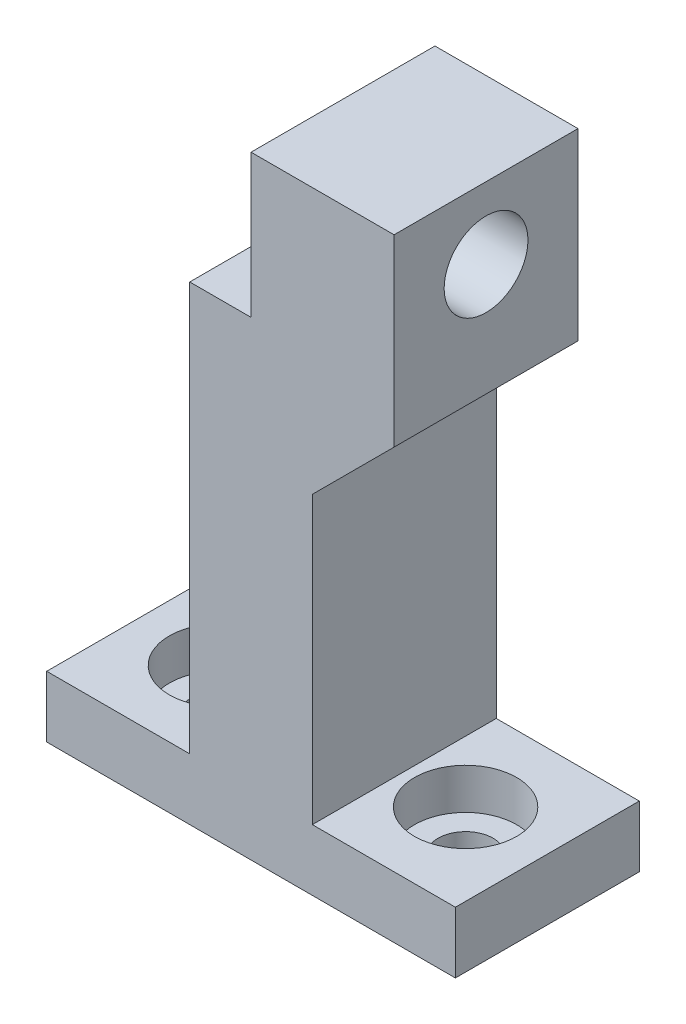
ISO-10303-21;
HEADER;
FILE_DESCRIPTION(('STEP AP214'),'2;1');
FILE_NAME('part.step','',(''),(''),'','','');
FILE_SCHEMA(('AUTOMOTIVE_DESIGN { 1 0 10303 214 1 1 1 1 }'));
ENDSEC;
DATA;
#1=APPLICATION_CONTEXT('core data for automotive mechanical design processes');
#2=APPLICATION_PROTOCOL_DEFINITION('international standard','automotive_design',2000,#1);
#3=PRODUCT_CONTEXT('',#1,'mechanical');
#4=PRODUCT('Part','Part','',(#3));
#5=PRODUCT_RELATED_PRODUCT_CATEGORY('part','',(#4));
#6=PRODUCT_DEFINITION_FORMATION('','',#4);
#7=PRODUCT_DEFINITION_CONTEXT('part definition',#1,'design');
#8=PRODUCT_DEFINITION('design','',#6,#7);
#9=PRODUCT_DEFINITION_SHAPE('','',#8);
#10=(LENGTH_UNIT() NAMED_UNIT(*) SI_UNIT(.MILLI.,.METRE.));
#11=(NAMED_UNIT(*) PLANE_ANGLE_UNIT() SI_UNIT($,.RADIAN.));
#12=(NAMED_UNIT(*) SI_UNIT($,.STERADIAN.) SOLID_ANGLE_UNIT());
#13=UNCERTAINTY_MEASURE_WITH_UNIT(LENGTH_MEASURE(1.E-05),#10,'distance_accuracy_value','');
#14=(GEOMETRIC_REPRESENTATION_CONTEXT(3) GLOBAL_UNCERTAINTY_ASSIGNED_CONTEXT((#13)) GLOBAL_UNIT_ASSIGNED_CONTEXT((#10,
#11,#12)) REPRESENTATION_CONTEXT('',''));
#15=CARTESIAN_POINT('',(0.,0.,0.));
#16=DIRECTION('',(0.,0.,1.));
#17=DIRECTION('',(1.,0.,0.));
#18=AXIS2_PLACEMENT_3D('',#15,#16,#17);
#19=CARTESIAN_POINT('',(3.,23.,4.5));
#20=DIRECTION('',(-1.,0.,0.));
#21=DIRECTION('',(0.,0.,1.));
#22=AXIS2_PLACEMENT_3D('',#19,#20,#21);
#23=PLANE('',#22);
#24=DIRECTION('',(0.,-1.,0.));
#25=VECTOR('',#24,1.);
#26=CARTESIAN_POINT('',(3.,23.,-4.5));
#27=LINE('',#26,#25);
#28=CARTESIAN_POINT('',(3.,17.,-4.5));
#29=VERTEX_POINT('',#28);
#30=CARTESIAN_POINT('',(3.,3.,-4.5));
#31=VERTEX_POINT('',#30);
#32=EDGE_CURVE('E184',#29,#31,#27,.T.);
#33=ORIENTED_EDGE('',*,*,#32,.F.);
#34=DIRECTION('',(0.,0.,1.));
#35=VECTOR('',#34,1.);
#36=CARTESIAN_POINT('',(3.,17.,4.5));
#37=LINE('',#36,#35);
#38=CARTESIAN_POINT('',(3.,17.,4.5));
#39=VERTEX_POINT('',#38);
#40=EDGE_CURVE('E58',#29,#39,#37,.T.);
#41=ORIENTED_EDGE('',*,*,#40,.T.);
#42=DIRECTION('',(0.,-1.,0.));
#43=VECTOR('',#42,1.);
#44=CARTESIAN_POINT('',(3.,23.,4.5));
#45=LINE('',#44,#43);
#46=CARTESIAN_POINT('',(3.,3.,4.5));
#47=VERTEX_POINT('',#46);
#48=EDGE_CURVE('E172',#39,#47,#45,.T.);
#49=ORIENTED_EDGE('',*,*,#48,.T.);
#50=DIRECTION('',(0.,0.,-1.));
#51=VECTOR('',#50,1.);
#52=CARTESIAN_POINT('',(3.,3.,4.5));
#53=LINE('',#52,#51);
#54=EDGE_CURVE('E164',#47,#31,#53,.T.);
#55=ORIENTED_EDGE('',*,*,#54,.T.);
#56=EDGE_LOOP('',(#33,#41,#49,#55));
#57=FACE_BOUND('',#56,.T.);
#58=ADVANCED_FACE('F35',(#57),#23,.F.);
#59=CARTESIAN_POINT('',(0.,23.,0.));
#60=DIRECTION('',(0.,-1.,0.));
#61=DIRECTION('',(0.,0.,-1.));
#62=AXIS2_PLACEMENT_3D('',#59,#60,#61);
#63=PLANE('',#62);
#64=DIRECTION('',(0.,0.,1.));
#65=VECTOR('',#64,1.);
#66=CARTESIAN_POINT('',(0.,23.,-4.5));
#67=LINE('',#66,#65);
#68=CARTESIAN_POINT('',(0.,23.,-4.5));
#69=VERTEX_POINT('',#68);
#70=CARTESIAN_POINT('',(0.,23.,4.5));
#71=VERTEX_POINT('',#70);
#72=EDGE_CURVE('E133',#69,#71,#67,.T.);
#73=ORIENTED_EDGE('',*,*,#72,.F.);
#74=DIRECTION('',(-1.,0.,0.));
#75=VECTOR('',#74,1.);
#76=CARTESIAN_POINT('',(-3.,23.,-4.5));
#77=LINE('',#76,#75);
#78=CARTESIAN_POINT('',(-3.,23.,-4.5));
#79=VERTEX_POINT('',#78);
#80=EDGE_CURVE('E165',#69,#79,#77,.T.);
#81=ORIENTED_EDGE('',*,*,#80,.T.);
#82=DIRECTION('',(0.,0.,1.));
#83=VECTOR('',#82,1.);
#84=CARTESIAN_POINT('',(-3.,23.,4.5));
#85=LINE('',#84,#83);
#86=CARTESIAN_POINT('',(-3.,23.,4.5));
#87=VERTEX_POINT('',#86);
#88=EDGE_CURVE('E167',#79,#87,#85,.T.);
#89=ORIENTED_EDGE('',*,*,#88,.T.);
#90=DIRECTION('',(1.,0.,0.));
#91=VECTOR('',#90,1.);
#92=CARTESIAN_POINT('',(-3.,23.,4.5));
#93=LINE('',#92,#91);
#94=EDGE_CURVE('E170',#87,#71,#93,.T.);
#95=ORIENTED_EDGE('',*,*,#94,.T.);
#96=EDGE_LOOP('',(#73,#81,#89,#95));
#97=FACE_BOUND('',#96,.T.);
#98=ADVANCED_FACE('F266',(#97),#63,.F.);
#99=CARTESIAN_POINT('',(0.,3.,0.));
#100=DIRECTION('',(0.,-1.,0.));
#101=DIRECTION('',(0.,0.,-1.));
#102=AXIS2_PLACEMENT_3D('',#99,#100,#101);
#103=PLANE('',#102);
#104=CARTESIAN_POINT('',(6.,3.,0.));
#105=DIRECTION('',(0.,1.,0.));
#106=DIRECTION('',(0.,0.,1.));
#107=AXIS2_PLACEMENT_3D('',#104,#105,#106);
#108=CIRCLE('',#107,2.5);
#109=CARTESIAN_POINT('',(6.,3.,2.5));
#110=VERTEX_POINT('',#109);
#111=EDGE_CURVE('E186',#110,#110,#108,.T.);
#112=ORIENTED_EDGE('',*,*,#111,.F.);
#113=EDGE_LOOP('',(#112));
#114=FACE_BOUND('',#113,.T.);
#115=ORIENTED_EDGE('',*,*,#54,.F.);
#116=DIRECTION('',(1.,0.,0.));
#117=VECTOR('',#116,1.);
#118=CARTESIAN_POINT('',(-10.,3.,4.5));
#119=LINE('',#118,#117);
#120=CARTESIAN_POINT('',(10.,3.,4.5));
#121=VERTEX_POINT('',#120);
#122=EDGE_CURVE('E217',#47,#121,#119,.T.);
#123=ORIENTED_EDGE('',*,*,#122,.T.);
#124=DIRECTION('',(0.,0.,-1.));
#125=VECTOR('',#124,1.);
#126=CARTESIAN_POINT('',(10.,3.,4.5));
#127=LINE('',#126,#125);
#128=CARTESIAN_POINT('',(10.,3.,-4.5));
#129=VERTEX_POINT('',#128);
#130=EDGE_CURVE('E207',#121,#129,#127,.T.);
#131=ORIENTED_EDGE('',*,*,#130,.T.);
#132=DIRECTION('',(-1.,0.,0.));
#133=VECTOR('',#132,1.);
#134=CARTESIAN_POINT('',(-10.,3.,-4.5));
#135=LINE('',#134,#133);
#136=EDGE_CURVE('E212',#129,#31,#135,.T.);
#137=ORIENTED_EDGE('',*,*,#136,.T.);
#138=EDGE_LOOP('',(#115,#123,#131,#137));
#139=FACE_BOUND('',#138,.T.);
#140=ADVANCED_FACE('F261',(#114,#139),#103,.F.);
#141=CARTESIAN_POINT('',(-6.,3.,0.));
#142=DIRECTION('',(0.,1.,0.));
#143=DIRECTION('',(0.,0.,1.));
#144=AXIS2_PLACEMENT_3D('',#141,#142,#143);
#145=CIRCLE('',#144,2.5);
#146=CARTESIAN_POINT('',(-6.,3.,2.5));
#147=VERTEX_POINT('',#146);
#148=EDGE_CURVE('E191',#147,#147,#145,.T.);
#149=ORIENTED_EDGE('',*,*,#148,.F.);
#150=EDGE_LOOP('',(#149));
#151=FACE_BOUND('',#150,.T.);
#152=DIRECTION('',(0.,0.,1.));
#153=VECTOR('',#152,1.);
#154=CARTESIAN_POINT('',(-3.,3.,4.5));
#155=LINE('',#154,#153);
#156=CARTESIAN_POINT('',(-3.,3.,-4.5));
#157=VERTEX_POINT('',#156);
#158=CARTESIAN_POINT('',(-3.,3.,4.5));
#159=VERTEX_POINT('',#158);
#160=EDGE_CURVE('E168',#157,#159,#155,.T.);
#161=ORIENTED_EDGE('',*,*,#160,.F.);
#162=CARTESIAN_POINT('',(-10.,3.,-4.5));
#163=VERTEX_POINT('',#162);
#164=EDGE_CURVE('E210',#157,#163,#135,.T.);
#165=ORIENTED_EDGE('',*,*,#164,.T.);
#166=DIRECTION('',(0.,0.,1.));
#167=VECTOR('',#166,1.);
#168=CARTESIAN_POINT('',(-10.,3.,4.5));
#169=LINE('',#168,#167);
#170=CARTESIAN_POINT('',(-10.,3.,4.5));
#171=VERTEX_POINT('',#170);
#172=EDGE_CURVE('E215',#163,#171,#169,.T.);
#173=ORIENTED_EDGE('',*,*,#172,.T.);
#174=EDGE_CURVE('E218',#171,#159,#119,.T.);
#175=ORIENTED_EDGE('',*,*,#174,.T.);
#176=EDGE_LOOP('',(#161,#165,#173,#175));
#177=FACE_BOUND('',#176,.T.);
#178=ADVANCED_FACE('F251',(#151,#177),#103,.F.);
#179=CARTESIAN_POINT('',(6.,0.,0.));
#180=DIRECTION('',(0.,1.,0.));
#181=DIRECTION('',(0.,0.,1.));
#182=AXIS2_PLACEMENT_3D('',#179,#180,#181);
#183=CYLINDRICAL_SURFACE('',#182,1.35);
#184=CARTESIAN_POINT('',(6.,0.,0.));
#185=DIRECTION('',(0.,1.,0.));
#186=DIRECTION('',(0.,0.,1.));
#187=AXIS2_PLACEMENT_3D('',#184,#185,#186);
#188=CIRCLE('',#187,1.35);
#189=CARTESIAN_POINT('',(6.,0.,1.35));
#190=VERTEX_POINT('',#189);
#191=EDGE_CURVE('E203',#190,#190,#188,.T.);
#192=ORIENTED_EDGE('',*,*,#191,.F.);
#193=EDGE_LOOP('',(#192));
#194=FACE_BOUND('',#193,.T.);
#195=CARTESIAN_POINT('',(6.,1.,0.));
#196=DIRECTION('',(0.,1.,0.));
#197=DIRECTION('',(0.,0.,1.));
#198=AXIS2_PLACEMENT_3D('',#195,#196,#197);
#199=CIRCLE('',#198,1.35);
#200=CARTESIAN_POINT('',(6.,1.,1.35));
#201=VERTEX_POINT('',#200);
#202=EDGE_CURVE('E206',#201,#201,#199,.F.);
#203=ORIENTED_EDGE('',*,*,#202,.F.);
#204=EDGE_LOOP('',(#203));
#205=FACE_BOUND('',#204,.T.);
#206=ADVANCED_FACE('F248',(#194,#205),#183,.F.);
#207=CARTESIAN_POINT('',(-6.,0.,0.));
#208=DIRECTION('',(0.,1.,0.));
#209=DIRECTION('',(0.,0.,1.));
#210=AXIS2_PLACEMENT_3D('',#207,#208,#209);
#211=CYLINDRICAL_SURFACE('',#210,1.35);
#212=CARTESIAN_POINT('',(-6.,0.,0.));
#213=DIRECTION('',(0.,1.,0.));
#214=DIRECTION('',(0.,0.,1.));
#215=AXIS2_PLACEMENT_3D('',#212,#213,#214);
#216=CIRCLE('',#215,1.35);
#217=CARTESIAN_POINT('',(-6.,0.,1.35));
#218=VERTEX_POINT('',#217);
#219=EDGE_CURVE('E199',#218,#218,#216,.T.);
#220=ORIENTED_EDGE('',*,*,#219,.F.);
#221=EDGE_LOOP('',(#220));
#222=FACE_BOUND('',#221,.T.);
#223=CARTESIAN_POINT('',(-6.,1.,0.));
#224=DIRECTION('',(0.,1.,0.));
#225=DIRECTION('',(0.,0.,1.));
#226=AXIS2_PLACEMENT_3D('',#223,#224,#225);
#227=CIRCLE('',#226,1.35);
#228=CARTESIAN_POINT('',(-6.,1.,1.35));
#229=VERTEX_POINT('',#228);
#230=EDGE_CURVE('E190',#229,#229,#227,.F.);
#231=ORIENTED_EDGE('',*,*,#230,.F.);
#232=EDGE_LOOP('',(#231));
#233=FACE_BOUND('',#232,.T.);
#234=ADVANCED_FACE('F250',(#222,#233),#211,.F.);
#235=CARTESIAN_POINT('',(10.,3.,4.5));
#236=DIRECTION('',(-1.,0.,0.));
#237=DIRECTION('',(0.,0.,1.));
#238=AXIS2_PLACEMENT_3D('',#235,#236,#237);
#239=PLANE('',#238);
#240=DIRECTION('',(0.,0.,-1.));
#241=VECTOR('',#240,1.);
#242=CARTESIAN_POINT('',(10.,0.,4.5));
#243=LINE('',#242,#241);
#244=CARTESIAN_POINT('',(10.,0.,4.5));
#245=VERTEX_POINT('',#244);
#246=CARTESIAN_POINT('',(10.,0.,-4.5));
#247=VERTEX_POINT('',#246);
#248=EDGE_CURVE('E202',#245,#247,#243,.T.);
#249=ORIENTED_EDGE('',*,*,#248,.T.);
#250=DIRECTION('',(0.,-1.,0.));
#251=VECTOR('',#250,1.);
#252=CARTESIAN_POINT('',(10.,3.,-4.5));
#253=LINE('',#252,#251);
#254=EDGE_CURVE('E236',#129,#247,#253,.T.);
#255=ORIENTED_EDGE('',*,*,#254,.F.);
#256=ORIENTED_EDGE('',*,*,#130,.F.);
#257=DIRECTION('',(0.,-1.,0.));
#258=VECTOR('',#257,1.);
#259=CARTESIAN_POINT('',(10.,3.,4.5));
#260=LINE('',#259,#258);
#261=EDGE_CURVE('E220',#121,#245,#260,.T.);
#262=ORIENTED_EDGE('',*,*,#261,.T.);
#263=EDGE_LOOP('',(#249,#255,#256,#262));
#264=FACE_BOUND('',#263,.T.);
#265=ADVANCED_FACE('F258',(#264),#239,.F.);
#266=CARTESIAN_POINT('',(-10.,3.,-4.5));
#267=DIRECTION('',(0.,0.,1.));
#268=DIRECTION('',(1.,0.,0.));
#269=AXIS2_PLACEMENT_3D('',#266,#267,#268);
#270=PLANE('',#269);
#271=DIRECTION('',(-1.,0.,0.));
#272=VECTOR('',#271,1.);
#273=CARTESIAN_POINT('',(-10.,0.,-4.5));
#274=LINE('',#273,#272);
#275=CARTESIAN_POINT('',(-10.,0.,-4.5));
#276=VERTEX_POINT('',#275);
#277=EDGE_CURVE('E223',#247,#276,#274,.T.);
#278=ORIENTED_EDGE('',*,*,#277,.T.);
#279=DIRECTION('',(0.,-1.,0.));
#280=VECTOR('',#279,1.);
#281=CARTESIAN_POINT('',(-10.,3.,-4.5));
#282=LINE('',#281,#280);
#283=EDGE_CURVE('E233',#163,#276,#282,.T.);
#284=ORIENTED_EDGE('',*,*,#283,.F.);
#285=ORIENTED_EDGE('',*,*,#164,.F.);
#286=DIRECTION('',(0.,-1.,0.));
#287=VECTOR('',#286,1.);
#288=CARTESIAN_POINT('',(-3.,23.,-4.5));
#289=LINE('',#288,#287);
#290=EDGE_CURVE('E181',#79,#157,#289,.T.);
#291=ORIENTED_EDGE('',*,*,#290,.F.);
#292=ORIENTED_EDGE('',*,*,#80,.F.);
#293=DIRECTION('',(0.,-1.,0.));
#294=VECTOR('',#293,1.);
#295=CARTESIAN_POINT('',(0.,30.,-4.5));
#296=LINE('',#295,#294);
#297=CARTESIAN_POINT('',(0.,30.,-4.5));
#298=VERTEX_POINT('',#297);
#299=EDGE_CURVE('E129',#298,#69,#296,.T.);
#300=ORIENTED_EDGE('',*,*,#299,.F.);
#301=DIRECTION('',(-1.,0.,0.));
#302=VECTOR('',#301,1.);
#303=CARTESIAN_POINT('',(3.,30.,-4.5));
#304=LINE('',#303,#302);
#305=CARTESIAN_POINT('',(7.,30.,-4.5));
#306=VERTEX_POINT('',#305);
#307=EDGE_CURVE('E122',#306,#298,#304,.T.);
#308=ORIENTED_EDGE('',*,*,#307,.F.);
#309=DIRECTION('',(0.,1.,0.));
#310=VECTOR('',#309,1.);
#311=CARTESIAN_POINT('',(7.,30.,-4.5));
#312=LINE('',#311,#310);
#313=CARTESIAN_POINT('',(7.,21.,-4.5));
#314=VERTEX_POINT('',#313);
#315=EDGE_CURVE('E126',#314,#306,#312,.T.);
#316=ORIENTED_EDGE('',*,*,#315,.F.);
#317=DIRECTION('',(0.707106781186549,0.707106781186546,0.));
#318=VECTOR('',#317,1.);
#319=CARTESIAN_POINT('',(-10.5,3.50000000000003,-4.5));
#320=LINE('',#319,#318);
#321=EDGE_CURVE('E45',#314,#29,#320,.F.);
#322=ORIENTED_EDGE('',*,*,#321,.T.);
#323=ORIENTED_EDGE('',*,*,#32,.T.);
#324=ORIENTED_EDGE('',*,*,#136,.F.);
#325=ORIENTED_EDGE('',*,*,#254,.T.);
#326=EDGE_LOOP('',(#278,#284,#285,#291,#292,#300,#308,#316,#322,#323,#324,#325));
#327=FACE_BOUND('',#326,.T.);
#328=ADVANCED_FACE('F124',(#327),#270,.F.);
#329=CARTESIAN_POINT('',(-10.,3.,4.5));
#330=DIRECTION('',(1.,0.,0.));
#331=DIRECTION('',(0.,0.,-1.));
#332=AXIS2_PLACEMENT_3D('',#329,#330,#331);
#333=PLANE('',#332);
#334=DIRECTION('',(0.,0.,1.));
#335=VECTOR('',#334,1.);
#336=CARTESIAN_POINT('',(-10.,0.,4.5));
#337=LINE('',#336,#335);
#338=CARTESIAN_POINT('',(-10.,0.,4.5));
#339=VERTEX_POINT('',#338);
#340=EDGE_CURVE('E225',#276,#339,#337,.T.);
#341=ORIENTED_EDGE('',*,*,#340,.T.);
#342=DIRECTION('',(0.,-1.,0.));
#343=VECTOR('',#342,1.);
#344=CARTESIAN_POINT('',(-10.,3.,4.5));
#345=LINE('',#344,#343);
#346=EDGE_CURVE('E230',#171,#339,#345,.T.);
#347=ORIENTED_EDGE('',*,*,#346,.F.);
#348=ORIENTED_EDGE('',*,*,#172,.F.);
#349=ORIENTED_EDGE('',*,*,#283,.T.);
#350=EDGE_LOOP('',(#341,#347,#348,#349));
#351=FACE_BOUND('',#350,.T.);
#352=ADVANCED_FACE('F327',(#351),#333,.F.);
#353=CARTESIAN_POINT('',(-10.,3.,4.5));
#354=DIRECTION('',(0.,0.,-1.));
#355=DIRECTION('',(-1.,0.,0.));
#356=AXIS2_PLACEMENT_3D('',#353,#354,#355);
#357=PLANE('',#356);
#358=DIRECTION('',(1.,0.,0.));
#359=VECTOR('',#358,1.);
#360=CARTESIAN_POINT('',(-10.,0.,4.5));
#361=LINE('',#360,#359);
#362=EDGE_CURVE('E211',#339,#245,#361,.T.);
#363=ORIENTED_EDGE('',*,*,#362,.T.);
#364=ORIENTED_EDGE('',*,*,#261,.F.);
#365=ORIENTED_EDGE('',*,*,#122,.F.);
#366=ORIENTED_EDGE('',*,*,#48,.F.);
#367=DIRECTION('',(-0.707106781186549,-0.707106781186546,0.));
#368=VECTOR('',#367,1.);
#369=CARTESIAN_POINT('',(-10.5,3.50000000000003,4.5));
#370=LINE('',#369,#368);
#371=CARTESIAN_POINT('',(7.,21.,4.5));
#372=VERTEX_POINT('',#371);
#373=EDGE_CURVE('E11',#39,#372,#370,.F.);
#374=ORIENTED_EDGE('',*,*,#373,.T.);
#375=DIRECTION('',(0.,-1.,0.));
#376=VECTOR('',#375,1.);
#377=CARTESIAN_POINT('',(7.,30.,4.5));
#378=LINE('',#377,#376);
#379=CARTESIAN_POINT('',(7.,30.,4.5));
#380=VERTEX_POINT('',#379);
#381=EDGE_CURVE('E143',#380,#372,#378,.T.);
#382=ORIENTED_EDGE('',*,*,#381,.F.);
#383=DIRECTION('',(1.,0.,0.));
#384=VECTOR('',#383,1.);
#385=CARTESIAN_POINT('',(3.,30.,4.5));
#386=LINE('',#385,#384);
#387=CARTESIAN_POINT('',(0.,30.,4.5));
#388=VERTEX_POINT('',#387);
#389=EDGE_CURVE('E139',#388,#380,#386,.T.);
#390=ORIENTED_EDGE('',*,*,#389,.F.);
#391=DIRECTION('',(0.,-1.,0.));
#392=VECTOR('',#391,1.);
#393=CARTESIAN_POINT('',(0.,30.,4.5));
#394=LINE('',#393,#392);
#395=EDGE_CURVE('E158',#388,#71,#394,.T.);
#396=ORIENTED_EDGE('',*,*,#395,.T.);
#397=ORIENTED_EDGE('',*,*,#94,.F.);
#398=DIRECTION('',(0.,-1.,0.));
#399=VECTOR('',#398,1.);
#400=CARTESIAN_POINT('',(-3.,23.,4.5));
#401=LINE('',#400,#399);
#402=EDGE_CURVE('E178',#87,#159,#401,.T.);
#403=ORIENTED_EDGE('',*,*,#402,.T.);
#404=ORIENTED_EDGE('',*,*,#174,.F.);
#405=ORIENTED_EDGE('',*,*,#346,.T.);
#406=EDGE_LOOP('',(#363,#364,#365,#366,#374,#382,#390,#396,#397,#403,#404,#405));
#407=FACE_BOUND('',#406,.T.);
#408=ADVANCED_FACE('F306',(#407),#357,.F.);
#409=CARTESIAN_POINT('',(0.,0.,0.));
#410=DIRECTION('',(0.,-1.,0.));
#411=DIRECTION('',(0.,0.,-1.));
#412=AXIS2_PLACEMENT_3D('',#409,#410,#411);
#413=PLANE('',#412);
#414=ORIENTED_EDGE('',*,*,#219,.T.);
#415=EDGE_LOOP('',(#414));
#416=FACE_BOUND('',#415,.T.);
#417=ORIENTED_EDGE('',*,*,#191,.T.);
#418=EDGE_LOOP('',(#417));
#419=FACE_BOUND('',#418,.T.);
#420=ORIENTED_EDGE('',*,*,#248,.F.);
#421=ORIENTED_EDGE('',*,*,#362,.F.);
#422=ORIENTED_EDGE('',*,*,#340,.F.);
#423=ORIENTED_EDGE('',*,*,#277,.F.);
#424=EDGE_LOOP('',(#420,#421,#422,#423));
#425=FACE_BOUND('',#424,.T.);
#426=ADVANCED_FACE('F280',(#416,#419,#425),#413,.T.);
#427=CARTESIAN_POINT('',(-6.,1.,0.));
#428=DIRECTION('',(0.,1.,0.));
#429=DIRECTION('',(0.,0.,1.));
#430=AXIS2_PLACEMENT_3D('',#427,#428,#429);
#431=PLANE('',#430);
#432=CARTESIAN_POINT('',(-6.,1.,0.));
#433=DIRECTION('',(0.,1.,0.));
#434=DIRECTION('',(0.,0.,1.));
#435=AXIS2_PLACEMENT_3D('',#432,#433,#434);
#436=CIRCLE('',#435,2.5);
#437=CARTESIAN_POINT('',(-6.,1.,2.5));
#438=VERTEX_POINT('',#437);
#439=EDGE_CURVE('E187',#438,#438,#436,.T.);
#440=ORIENTED_EDGE('',*,*,#439,.T.);
#441=EDGE_LOOP('',(#440));
#442=FACE_BOUND('',#441,.T.);
#443=ORIENTED_EDGE('',*,*,#230,.T.);
#444=EDGE_LOOP('',(#443));
#445=FACE_BOUND('',#444,.T.);
#446=ADVANCED_FACE('F276',(#442,#445),#431,.T.);
#447=CARTESIAN_POINT('',(-6.,1.,0.));
#448=DIRECTION('',(0.,1.,0.));
#449=DIRECTION('',(0.,0.,1.));
#450=AXIS2_PLACEMENT_3D('',#447,#448,#449);
#451=CYLINDRICAL_SURFACE('',#450,2.5);
#452=ORIENTED_EDGE('',*,*,#439,.F.);
#453=EDGE_LOOP('',(#452));
#454=FACE_BOUND('',#453,.T.);
#455=ORIENTED_EDGE('',*,*,#148,.T.);
#456=EDGE_LOOP('',(#455));
#457=FACE_BOUND('',#456,.T.);
#458=ADVANCED_FACE('F279',(#454,#457),#451,.F.);
#459=CARTESIAN_POINT('',(6.,1.,0.));
#460=DIRECTION('',(0.,1.,0.));
#461=DIRECTION('',(0.,0.,1.));
#462=AXIS2_PLACEMENT_3D('',#459,#460,#461);
#463=PLANE('',#462);
#464=CARTESIAN_POINT('',(6.,1.,0.));
#465=DIRECTION('',(0.,1.,0.));
#466=DIRECTION('',(0.,0.,1.));
#467=AXIS2_PLACEMENT_3D('',#464,#465,#466);
#468=CIRCLE('',#467,2.5);
#469=CARTESIAN_POINT('',(6.,1.,2.5));
#470=VERTEX_POINT('',#469);
#471=EDGE_CURVE('E194',#470,#470,#468,.T.);
#472=ORIENTED_EDGE('',*,*,#471,.T.);
#473=EDGE_LOOP('',(#472));
#474=FACE_BOUND('',#473,.T.);
#475=ORIENTED_EDGE('',*,*,#202,.T.);
#476=EDGE_LOOP('',(#475));
#477=FACE_BOUND('',#476,.T.);
#478=ADVANCED_FACE('F246',(#474,#477),#463,.T.);
#479=CARTESIAN_POINT('',(6.,1.,0.));
#480=DIRECTION('',(0.,1.,0.));
#481=DIRECTION('',(0.,0.,1.));
#482=AXIS2_PLACEMENT_3D('',#479,#480,#481);
#483=CYLINDRICAL_SURFACE('',#482,2.5);
#484=ORIENTED_EDGE('',*,*,#471,.F.);
#485=EDGE_LOOP('',(#484));
#486=FACE_BOUND('',#485,.T.);
#487=ORIENTED_EDGE('',*,*,#111,.T.);
#488=EDGE_LOOP('',(#487));
#489=FACE_BOUND('',#488,.T.);
#490=ADVANCED_FACE('F287',(#486,#489),#483,.F.);
#491=CARTESIAN_POINT('',(-3.,23.,4.5));
#492=DIRECTION('',(1.,0.,0.));
#493=DIRECTION('',(0.,0.,-1.));
#494=AXIS2_PLACEMENT_3D('',#491,#492,#493);
#495=PLANE('',#494);
#496=ORIENTED_EDGE('',*,*,#160,.T.);
#497=ORIENTED_EDGE('',*,*,#402,.F.);
#498=ORIENTED_EDGE('',*,*,#88,.F.);
#499=ORIENTED_EDGE('',*,*,#290,.T.);
#500=EDGE_LOOP('',(#496,#497,#498,#499));
#501=FACE_BOUND('',#500,.T.);
#502=ADVANCED_FACE('F275',(#501),#495,.F.);
#503=CARTESIAN_POINT('',(0.,30.,-4.5));
#504=DIRECTION('',(1.,0.,0.));
#505=DIRECTION('',(0.,0.,-1.));
#506=AXIS2_PLACEMENT_3D('',#503,#504,#505);
#507=PLANE('',#506);
#508=CARTESIAN_POINT('',(0.,26.5,0.));
#509=DIRECTION('',(-1.,0.,0.));
#510=DIRECTION('',(0.,0.,1.));
#511=AXIS2_PLACEMENT_3D('',#508,#509,#510);
#512=CIRCLE('',#511,2.05);
#513=CARTESIAN_POINT('',(0.,26.5,2.05));
#514=VERTEX_POINT('',#513);
#515=EDGE_CURVE('E151',#514,#514,#512,.T.);
#516=ORIENTED_EDGE('',*,*,#515,.F.);
#517=EDGE_LOOP('',(#516));
#518=FACE_BOUND('',#517,.T.);
#519=ORIENTED_EDGE('',*,*,#72,.T.);
#520=ORIENTED_EDGE('',*,*,#395,.F.);
#521=DIRECTION('',(0.,0.,1.));
#522=VECTOR('',#521,1.);
#523=CARTESIAN_POINT('',(0.,30.,-4.5));
#524=LINE('',#523,#522);
#525=EDGE_CURVE('E132',#298,#388,#524,.T.);
#526=ORIENTED_EDGE('',*,*,#525,.F.);
#527=ORIENTED_EDGE('',*,*,#299,.T.);
#528=EDGE_LOOP('',(#519,#520,#526,#527));
#529=FACE_BOUND('',#528,.T.);
#530=ADVANCED_FACE('F294',(#518,#529),#507,.F.);
#531=CARTESIAN_POINT('',(0.,30.,0.));
#532=DIRECTION('',(0.,-1.,0.));
#533=DIRECTION('',(0.,0.,-1.));
#534=AXIS2_PLACEMENT_3D('',#531,#532,#533);
#535=PLANE('',#534);
#536=ORIENTED_EDGE('',*,*,#389,.T.);
#537=DIRECTION('',(0.,0.,1.));
#538=VECTOR('',#537,1.);
#539=CARTESIAN_POINT('',(7.,30.,-4.5));
#540=LINE('',#539,#538);
#541=EDGE_CURVE('E136',#306,#380,#540,.T.);
#542=ORIENTED_EDGE('',*,*,#541,.F.);
#543=ORIENTED_EDGE('',*,*,#307,.T.);
#544=ORIENTED_EDGE('',*,*,#525,.T.);
#545=EDGE_LOOP('',(#536,#542,#543,#544));
#546=FACE_BOUND('',#545,.T.);
#547=ADVANCED_FACE('F137',(#546),#535,.F.);
#548=CARTESIAN_POINT('',(7.,0.,0.));
#549=DIRECTION('',(-1.,0.,0.));
#550=DIRECTION('',(0.,0.,1.));
#551=AXIS2_PLACEMENT_3D('',#548,#549,#550);
#552=PLANE('',#551);
#553=CARTESIAN_POINT('',(7.,26.5,0.));
#554=DIRECTION('',(-1.,0.,0.));
#555=DIRECTION('',(0.,0.,1.));
#556=AXIS2_PLACEMENT_3D('',#553,#554,#555);
#557=CIRCLE('',#556,2.05);
#558=CARTESIAN_POINT('',(7.,26.5,2.05));
#559=VERTEX_POINT('',#558);
#560=EDGE_CURVE('E40',#559,#559,#557,.T.);
#561=ORIENTED_EDGE('',*,*,#560,.T.);
#562=EDGE_LOOP('',(#561));
#563=FACE_BOUND('',#562,.T.);
#564=ORIENTED_EDGE('',*,*,#315,.T.);
#565=ORIENTED_EDGE('',*,*,#541,.T.);
#566=ORIENTED_EDGE('',*,*,#381,.T.);
#567=DIRECTION('',(0.,0.,-1.));
#568=VECTOR('',#567,1.);
#569=CARTESIAN_POINT('',(7.,21.,-4.5));
#570=LINE('',#569,#568);
#571=EDGE_CURVE('E148',#372,#314,#570,.T.);
#572=ORIENTED_EDGE('',*,*,#571,.T.);
#573=EDGE_LOOP('',(#564,#565,#566,#572));
#574=FACE_BOUND('',#573,.T.);
#575=ADVANCED_FACE('F146',(#563,#574),#552,.F.);
#576=CARTESIAN_POINT('',(7.,21.,-4.5));
#577=DIRECTION('',(0.707106781186546,-0.707106781186549,0.));
#578=DIRECTION('',(0.,0.,1.));
#579=AXIS2_PLACEMENT_3D('',#576,#577,#578);
#580=PLANE('',#579);
#581=ORIENTED_EDGE('',*,*,#373,.F.);
#582=ORIENTED_EDGE('',*,*,#40,.F.);
#583=ORIENTED_EDGE('',*,*,#321,.F.);
#584=ORIENTED_EDGE('',*,*,#571,.F.);
#585=EDGE_LOOP('',(#581,#582,#583,#584));
#586=FACE_BOUND('',#585,.T.);
#587=ADVANCED_FACE('F38',(#586),#580,.T.);
#588=CARTESIAN_POINT('',(10.,26.5,0.));
#589=DIRECTION('',(-1.,0.,0.));
#590=DIRECTION('',(0.,0.,1.));
#591=AXIS2_PLACEMENT_3D('',#588,#589,#590);
#592=CYLINDRICAL_SURFACE('',#591,2.05);
#593=ORIENTED_EDGE('',*,*,#515,.T.);
#594=EDGE_LOOP('',(#593));
#595=FACE_BOUND('',#594,.T.);
#596=ORIENTED_EDGE('',*,*,#560,.F.);
#597=EDGE_LOOP('',(#596));
#598=FACE_BOUND('',#597,.T.);
#599=ADVANCED_FACE('F370',(#595,#598),#592,.F.);
#600=CLOSED_SHELL('',(#58,#98,#140,#178,#206,#234,#265,#328,#352,#408,#426,#446,#458,#478,#490,
#502,#530,#547,#575,#587,#599));
#601=MANIFOLD_SOLID_BREP('B2',#600);
#602=ADVANCED_BREP_SHAPE_REPRESENTATION('',(#18,#601),#14);
#603=SHAPE_DEFINITION_REPRESENTATION(#9,#602);
ENDSEC;
END-ISO-10303-21;
